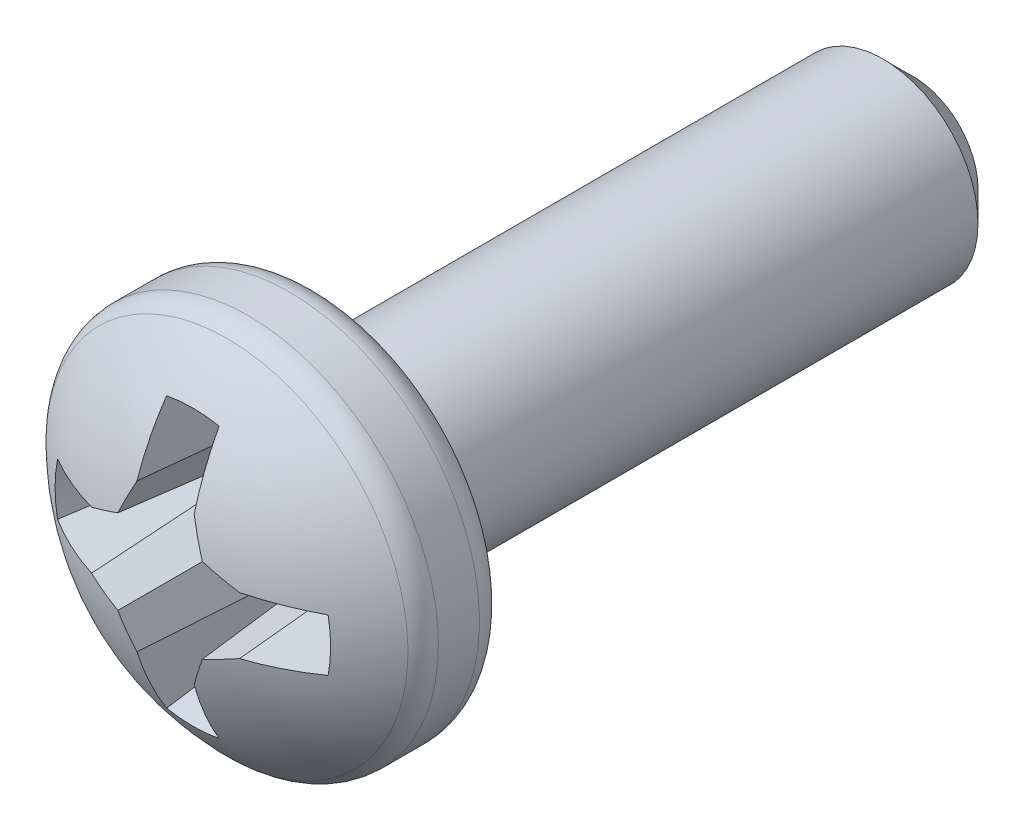
ISO-10303-21;
HEADER;
FILE_DESCRIPTION(('STEP AP214'),'2;1');
FILE_NAME('part.step','',(''),(''),'','','');
FILE_SCHEMA(('AUTOMOTIVE_DESIGN { 1 0 10303 214 1 1 1 1 }'));
ENDSEC;
DATA;
#1=APPLICATION_CONTEXT('core data for automotive mechanical design processes');
#2=APPLICATION_PROTOCOL_DEFINITION('international standard','automotive_design',2000,#1);
#3=PRODUCT_CONTEXT('',#1,'mechanical');
#4=PRODUCT('Part','Part','',(#3));
#5=PRODUCT_RELATED_PRODUCT_CATEGORY('part','',(#4));
#6=PRODUCT_DEFINITION_FORMATION('','',#4);
#7=PRODUCT_DEFINITION_CONTEXT('part definition',#1,'design');
#8=PRODUCT_DEFINITION('design','',#6,#7);
#9=PRODUCT_DEFINITION_SHAPE('','',#8);
#10=(LENGTH_UNIT() NAMED_UNIT(*) SI_UNIT(.MILLI.,.METRE.));
#11=(NAMED_UNIT(*) PLANE_ANGLE_UNIT() SI_UNIT($,.RADIAN.));
#12=(NAMED_UNIT(*) SI_UNIT($,.STERADIAN.) SOLID_ANGLE_UNIT());
#13=UNCERTAINTY_MEASURE_WITH_UNIT(LENGTH_MEASURE(1.E-05),#10,'distance_accuracy_value','');
#14=(GEOMETRIC_REPRESENTATION_CONTEXT(3) GLOBAL_UNCERTAINTY_ASSIGNED_CONTEXT((#13)) GLOBAL_UNIT_ASSIGNED_CONTEXT((#10,
#11,#12)) REPRESENTATION_CONTEXT('',''));
#15=CARTESIAN_POINT('',(0.,0.,0.));
#16=DIRECTION('',(0.,0.,1.));
#17=DIRECTION('',(1.,0.,0.));
#18=AXIS2_PLACEMENT_3D('',#15,#16,#17);
#19=CARTESIAN_POINT('',(-0.767521674615797,0.791461441644268,0.413196607862429));
#20=DIRECTION('',(0.,0.,1.));
#21=DIRECTION('',(1.,0.,0.));
#22=AXIS2_PLACEMENT_3D('',#19,#20,#21);
#23=PLANE('',#22);
#24=DIRECTION('',(0.382683432365081,-0.92387953251129,0.));
#25=VECTOR('',#24,1.);
#26=CARTESIAN_POINT('',(-0.754207787845929,0.796976234112247,0.413196607862429));
#27=LINE('',#26,#25);
#28=CARTESIAN_POINT('',(-0.761778033261303,0.815252423264536,0.413196607862429));
#29=VERTEX_POINT('',#28);
#30=CARTESIAN_POINT('',(-0.756492089679838,0.802491026580226,0.413196607862429));
#31=VERTEX_POINT('',#30);
#32=EDGE_CURVE('E292',#29,#31,#27,.T.);
#33=ORIENTED_EDGE('',*,*,#32,.F.);
#34=DIRECTION('',(0.,1.,0.));
#35=VECTOR('',#34,1.);
#36=CARTESIAN_POINT('',(-0.761778033261302,0.791461441644268,0.413196607862429));
#37=LINE('',#36,#35);
#38=CARTESIAN_POINT('',(-0.761778033261302,0.827667770312269,0.413196607862429));
#39=VERTEX_POINT('',#38);
#40=EDGE_CURVE('E168',#39,#29,#37,.F.);
#41=ORIENTED_EDGE('',*,*,#40,.F.);
#42=CARTESIAN_POINT('',(-0.767521674615797,0.791461441644268,0.413196607862429));
#43=DIRECTION('',(0.,0.,1.));
#44=DIRECTION('',(1.,0.,0.));
#45=AXIS2_PLACEMENT_3D('',#42,#43,#44);
#46=CIRCLE('',#45,0.0366590732510296);
#47=CARTESIAN_POINT('',(-0.773265315970288,0.827667770312269,0.413196607862429));
#48=VERTEX_POINT('',#47);
#49=EDGE_CURVE('E159',#39,#48,#46,.T.);
#50=ORIENTED_EDGE('',*,*,#49,.T.);
#51=DIRECTION('',(0.,1.,0.));
#52=VECTOR('',#51,1.);
#53=CARTESIAN_POINT('',(-0.773265315970287,0.791461441644271,0.413196607862429));
#54=LINE('',#53,#52);
#55=CARTESIAN_POINT('',(-0.773265315970288,0.815252423264539,0.413196607862429));
#56=VERTEX_POINT('',#55);
#57=EDGE_CURVE('E166',#56,#48,#54,.T.);
#58=ORIENTED_EDGE('',*,*,#57,.F.);
#59=DIRECTION('',(0.382683432365079,0.923879532511291,0.));
#60=VECTOR('',#59,1.);
#61=CARTESIAN_POINT('',(-0.780835561385661,0.79697623411225,0.413196607862429));
#62=LINE('',#61,#60);
#63=CARTESIAN_POINT('',(-0.778551259551752,0.802491026580229,0.413196607862429));
#64=VERTEX_POINT('',#63);
#65=EDGE_CURVE('E301',#64,#56,#62,.T.);
#66=ORIENTED_EDGE('',*,*,#65,.F.);
#67=DIRECTION('',(0.923879532511289,0.382683432365086,0.));
#68=VECTOR('',#67,1.);
#69=CARTESIAN_POINT('',(-0.773036467083772,0.804775328414139,0.413196607862429));
#70=LINE('',#69,#68);
#71=CARTESIAN_POINT('',(-0.791312656236062,0.797205082998765,0.413196607862429));
#72=VERTEX_POINT('',#71);
#73=EDGE_CURVE('E307',#72,#64,#70,.T.);
#74=ORIENTED_EDGE('',*,*,#73,.F.);
#75=DIRECTION('',(1.,0.,0.));
#76=VECTOR('',#75,1.);
#77=CARTESIAN_POINT('',(-0.767521674615793,0.797205082998765,0.413196607862429));
#78=LINE('',#77,#76);
#79=CARTESIAN_POINT('',(-0.803728003323473,0.797205082997996,0.413196607853642));
#80=VERTEX_POINT('',#79);
#81=EDGE_CURVE('E313',#80,#72,#78,.T.);
#82=ORIENTED_EDGE('',*,*,#81,.F.);
#83=CARTESIAN_POINT('',(-0.767521674615794,0.791461441644271,0.413196607862429));
#84=DIRECTION('',(0.,0.,1.));
#85=DIRECTION('',(1.,0.,0.));
#86=AXIS2_PLACEMENT_3D('',#83,#84,#85);
#87=CIRCLE('',#86,0.0366590732924525);
#88=CARTESIAN_POINT('',(-0.803728003325736,0.78571780028978,0.413196607862429));
#89=VERTEX_POINT('',#88);
#90=EDGE_CURVE('E410',#80,#89,#87,.T.);
#91=ORIENTED_EDGE('',*,*,#90,.T.);
#92=DIRECTION('',(1.,0.,0.));
#93=VECTOR('',#92,1.);
#94=CARTESIAN_POINT('',(-0.767521674615797,0.78571780028978,0.413196607862429));
#95=LINE('',#94,#93);
#96=CARTESIAN_POINT('',(-0.791312656236065,0.78571780028978,0.413196607862429));
#97=VERTEX_POINT('',#96);
#98=EDGE_CURVE('E247',#97,#89,#95,.F.);
#99=ORIENTED_EDGE('',*,*,#98,.F.);
#100=DIRECTION('',(-0.923879532511292,0.382683432365076,0.));
#101=VECTOR('',#100,1.);
#102=CARTESIAN_POINT('',(-0.773036467083776,0.778147554874406,0.413196607862429));
#103=LINE('',#102,#101);
#104=CARTESIAN_POINT('',(-0.778551259551755,0.780431856708316,0.413196607862429));
#105=VERTEX_POINT('',#104);
#106=EDGE_CURVE('E248',#105,#97,#103,.T.);
#107=ORIENTED_EDGE('',*,*,#106,.F.);
#108=DIRECTION('',(-0.38268343236509,0.923879532511287,0.));
#109=VECTOR('',#108,1.);
#110=CARTESIAN_POINT('',(-0.780835561385665,0.785946649176296,0.413196607862429));
#111=LINE('',#110,#109);
#112=CARTESIAN_POINT('',(-0.77326531597029,0.767670460024005,0.413196607862429));
#113=VERTEX_POINT('',#112);
#114=EDGE_CURVE('E254',#113,#105,#111,.T.);
#115=ORIENTED_EDGE('',*,*,#114,.F.);
#116=DIRECTION('',(0.,1.,0.));
#117=VECTOR('',#116,1.);
#118=CARTESIAN_POINT('',(-0.773265315970291,0.791461441644275,0.413196607862429));
#119=LINE('',#118,#117);
#120=CARTESIAN_POINT('',(-0.77326531597029,0.755255112934143,0.413196607862429));
#121=VERTEX_POINT('',#120);
#122=EDGE_CURVE('E260',#121,#113,#119,.T.);
#123=ORIENTED_EDGE('',*,*,#122,.F.);
#124=CARTESIAN_POINT('',(-0.767521674615796,0.791461441644275,0.413196607862429));
#125=DIRECTION('',(0.,0.,1.));
#126=DIRECTION('',(1.,0.,0.));
#127=AXIS2_PLACEMENT_3D('',#124,#125,#126);
#128=CIRCLE('',#127,0.0366590732926404);
#129=CARTESIAN_POINT('',(-0.761778033261305,0.755255112934142,0.413196607862429));
#130=VERTEX_POINT('',#129);
#131=EDGE_CURVE('E336',#121,#130,#128,.T.);
#132=ORIENTED_EDGE('',*,*,#131,.T.);
#133=DIRECTION('',(0.,1.,0.));
#134=VECTOR('',#133,1.);
#135=CARTESIAN_POINT('',(-0.761778033261306,0.791461441644272,0.413196607862429));
#136=LINE('',#135,#134);
#137=CARTESIAN_POINT('',(-0.761778033261305,0.767670460024002,0.413196607862429));
#138=VERTEX_POINT('',#137);
#139=EDGE_CURVE('E266',#138,#130,#136,.F.);
#140=ORIENTED_EDGE('',*,*,#139,.F.);
#141=DIRECTION('',(-0.382683432365075,-0.923879532511293,0.));
#142=VECTOR('',#141,1.);
#143=CARTESIAN_POINT('',(-0.754207787845931,0.785946649176293,0.413196607862429));
#144=LINE('',#143,#142);
#145=CARTESIAN_POINT('',(-0.756492089679841,0.780431856708313,0.413196607862429));
#146=VERTEX_POINT('',#145);
#147=EDGE_CURVE('E267',#146,#138,#144,.T.);
#148=ORIENTED_EDGE('',*,*,#147,.F.);
#149=DIRECTION('',(-0.923879532511286,-0.382683432365092,0.));
#150=VECTOR('',#149,1.);
#151=CARTESIAN_POINT('',(-0.762006882147821,0.778147554874402,0.413196607862429));
#152=LINE('',#151,#150);
#153=CARTESIAN_POINT('',(-0.743730692995531,0.785717800289777,0.413196607862429));
#154=VERTEX_POINT('',#153);
#155=EDGE_CURVE('E273',#154,#146,#152,.T.);
#156=ORIENTED_EDGE('',*,*,#155,.F.);
#157=DIRECTION('',(1.,0.,0.));
#158=VECTOR('',#157,1.);
#159=CARTESIAN_POINT('',(-0.7675216746158,0.785717800289777,0.413196607862429));
#160=LINE('',#159,#158);
#161=CARTESIAN_POINT('',(-0.731315345947796,0.785717800289777,0.413196607862429));
#162=VERTEX_POINT('',#161);
#163=EDGE_CURVE('E279',#162,#154,#160,.F.);
#164=ORIENTED_EDGE('',*,*,#163,.F.);
#165=CARTESIAN_POINT('',(-0.767521674615797,0.791461441644268,0.413196607862429));
#166=DIRECTION('',(0.,0.,1.));
#167=DIRECTION('',(1.,0.,0.));
#168=AXIS2_PLACEMENT_3D('',#165,#166,#167);
#169=CIRCLE('',#168,0.0366590732510296);
#170=CARTESIAN_POINT('',(-0.731315345947796,0.797205082998762,0.413196607862429));
#171=VERTEX_POINT('',#170);
#172=EDGE_CURVE('E492',#162,#171,#169,.T.);
#173=ORIENTED_EDGE('',*,*,#172,.T.);
#174=DIRECTION('',(1.,0.,0.));
#175=VECTOR('',#174,1.);
#176=CARTESIAN_POINT('',(-0.767521674615797,0.797205082998762,0.413196607862429));
#177=LINE('',#176,#175);
#178=CARTESIAN_POINT('',(-0.743730692995528,0.797205082998762,0.413196607862429));
#179=VERTEX_POINT('',#178);
#180=EDGE_CURVE('E285',#179,#171,#177,.T.);
#181=ORIENTED_EDGE('',*,*,#180,.F.);
#182=DIRECTION('',(0.92387953251129,-0.382683432365083,0.));
#183=VECTOR('',#182,1.);
#184=CARTESIAN_POINT('',(-0.762006882147817,0.804775328414136,0.413196607862429));
#185=LINE('',#184,#183);
#186=EDGE_CURVE('E286',#31,#179,#185,.T.);
#187=ORIENTED_EDGE('',*,*,#186,.F.);
#188=EDGE_LOOP('',(#33,#41,#50,#58,#66,#74,#82,#91,#99,#107,#115,#123,#132,#140,#148,#156,#164,
#173,#181,#187));
#189=FACE_BOUND('',#188,.T.);
#190=ADVANCED_FACE('F17',(#189),#23,.T.);
#191=CARTESIAN_POINT('',(-0.767521674615793,0.801303961329311,0.460047001563216));
#192=DIRECTION('',(0.,-0.996194698091744,0.0871557427476727));
#193=DIRECTION('',(0.,-0.0871557427476727,-0.996194698091744));
#194=AXIS2_PLACEMENT_3D('',#191,#192,#193);
#195=PLANE('',#194);
#196=DIRECTION('',(0.0173337504938446,-0.0871426484044557,-0.996045029063884));
#197=VECTOR('',#196,1.);
#198=CARTESIAN_POINT('',(-0.792056056740421,0.8009424097128,0.455914447676356));
#199=LINE('',#198,#197);
#200=CARTESIAN_POINT('',(-0.792056056740421,0.8009424097128,0.455914447676356));
#201=VERTEX_POINT('',#200);
#202=EDGE_CURVE('E310',#201,#72,#199,.T.);
#203=ORIENTED_EDGE('',*,*,#202,.F.);
#204=CARTESIAN_POINT('',(-0.8123693076876,0.80015108887588,0.446869609122098));
#205=CARTESIAN_POINT('',(-0.809180948004435,0.800321424804083,0.448816557690383));
#206=CARTESIAN_POINT('',(-0.805893997250592,0.800472536171256,0.450543768520713));
#207=CARTESIAN_POINT('',(-0.799122913601554,0.800736309783544,0.453558714705462));
#208=CARTESIAN_POINT('',(-0.795638780706358,0.800848972028658,0.45484645005988));
#209=CARTESIAN_POINT('',(-0.792056056740485,0.800942409712743,0.455914447676344));
#210=B_SPLINE_CURVE_WITH_KNOTS('',3,(#204,#205,#206,#207,#208,#209),.UNSPECIFIED.,.F.,.F.,(4,2,
4),(0.,0.0111485978671285,0.0222971957342569),.UNSPECIFIED.);
#211=CARTESIAN_POINT('',(-0.812369307677023,0.800151088874494,0.446869609106245));
#212=VERTEX_POINT('',#211);
#213=EDGE_CURVE('E409',#212,#201,#210,.T.);
#214=ORIENTED_EDGE('',*,*,#213,.F.);
#215=CARTESIAN_POINT('',(-0.812369307666445,0.800151088873107,0.446869609090391));
#216=CARTESIAN_POINT('',(-0.810932839888683,0.79966000435443,0.441256487356838));
#217=CARTESIAN_POINT('',(-0.809494497313129,0.799168961608414,0.435643843086986));
#218=CARTESIAN_POINT('',(-0.806614062531475,0.798186959649785,0.424419509338453));
#219=CARTESIAN_POINT('',(-0.805171970325285,0.797696000437175,0.418807819859794));
#220=CARTESIAN_POINT('',(-0.803728003321212,0.797205082997228,0.413196607844861));
#221=B_SPLINE_CURVE_WITH_KNOTS('',3,(#215,#216,#217,#218,#219,#220),.UNSPECIFIED.,.F.,.F.,(4,2,
4),(0.,0.0174443558891328,0.034888712201716),.UNSPECIFIED.);
#222=EDGE_CURVE('E318',#212,#80,#221,.T.);
#223=ORIENTED_EDGE('',*,*,#222,.T.);
#224=ORIENTED_EDGE('',*,*,#81,.T.);
#225=EDGE_LOOP('',(#203,#214,#223,#224));
#226=FACE_BOUND('',#225,.T.);
#227=ADVANCED_FACE('F427',(#226),#195,.T.);
#228=CARTESIAN_POINT('',(-0.774605039912152,0.808562198209984,0.460047001563216));
#229=DIRECTION('',(0.381227206369649,-0.920363891963225,0.0871557427476661));
#230=DIRECTION('',(0.923879532511289,0.382683432365086,0.));
#231=AXIS2_PLACEMENT_3D('',#228,#229,#230);
#232=PLANE('',#231);
#233=DIRECTION('',(0.0666626913468223,-0.0666626913468416,-0.995546167269401));
#234=VECTOR('',#233,1.);
#235=CARTESIAN_POINT('',(-0.781533038303313,0.805472805331791,0.457726739301586));
#236=LINE('',#235,#234);
#237=CARTESIAN_POINT('',(-0.781533038303313,0.805472805331791,0.457726739301586));
#238=VERTEX_POINT('',#237);
#239=EDGE_CURVE('E304',#238,#64,#236,.T.);
#240=ORIENTED_EDGE('',*,*,#239,.F.);
#241=CARTESIAN_POINT('',(-0.792056056740421,0.8009424097128,0.455914447676356));
#242=CARTESIAN_POINT('',(-0.790325687185486,0.801700049456703,0.456346321822599));
#243=CARTESIAN_POINT('',(-0.788583584204926,0.802456402296903,0.456713283197823));
#244=CARTESIAN_POINT('',(-0.785075911392557,0.8039665341699,0.457317380406233));
#245=CARTESIAN_POINT('',(-0.783310341560747,0.804720313202697,0.457554516239419));
#246=CARTESIAN_POINT('',(-0.781533038303313,0.805472805331791,0.457726739301586));
#247=B_SPLINE_CURVE_WITH_KNOTS('',3,(#241,#242,#243,#244,#245,#246),.UNSPECIFIED.,.F.,.F.,(4,2,
4),(0.,0.00580300590917737,0.0116060118183546),.UNSPECIFIED.);
#248=EDGE_CURVE('E439',#201,#238,#247,.T.);
#249=ORIENTED_EDGE('',*,*,#248,.F.);
#250=ORIENTED_EDGE('',*,*,#202,.T.);
#251=ORIENTED_EDGE('',*,*,#73,.T.);
#252=EDGE_LOOP('',(#240,#249,#250,#251));
#253=FACE_BOUND('',#252,.T.);
#254=ADVANCED_FACE('F431',(#253),#232,.T.);
#255=CARTESIAN_POINT('',(-0.784622431181506,0.79854480694063,0.460047001563216));
#256=DIRECTION('',(0.920363891963229,-0.381227206369643,0.0871557427476506));
#257=DIRECTION('',(0.382683432365079,0.923879532511291,0.));
#258=AXIS2_PLACEMENT_3D('',#255,#256,#257);
#259=PLANE('',#258);
#260=DIRECTION('',(0.0871426484044276,-0.0173337504938855,-0.996045029063886));
#261=VECTOR('',#260,1.);
#262=CARTESIAN_POINT('',(-0.777002642684322,0.8159958237689,0.455914447676355));
#263=LINE('',#262,#261);
#264=CARTESIAN_POINT('',(-0.777002642684322,0.8159958237689,0.455914447676355));
#265=VERTEX_POINT('',#264);
#266=EDGE_CURVE('E176',#265,#56,#263,.T.);
#267=ORIENTED_EDGE('',*,*,#266,.F.);
#268=CARTESIAN_POINT('',(-0.781533038303313,0.805472805331791,0.457726739301586));
#269=CARTESIAN_POINT('',(-0.780780546174218,0.807250108589226,0.457554516239419));
#270=CARTESIAN_POINT('',(-0.780026767141422,0.809015678421036,0.457317380406232));
#271=CARTESIAN_POINT('',(-0.778516635268425,0.812523351233405,0.456713283197822));
#272=CARTESIAN_POINT('',(-0.777760282428224,0.814265454213965,0.456346321822598));
#273=CARTESIAN_POINT('',(-0.777002642684322,0.8159958237689,0.455914447676355));
#274=B_SPLINE_CURVE_WITH_KNOTS('',3,(#268,#269,#270,#271,#272,#273),.UNSPECIFIED.,.F.,.F.,(4,2,
4),(0.,0.00580300590917795,0.0116060118183557),.UNSPECIFIED.);
#275=EDGE_CURVE('E445',#238,#265,#274,.T.);
#276=ORIENTED_EDGE('',*,*,#275,.F.);
#277=ORIENTED_EDGE('',*,*,#239,.T.);
#278=ORIENTED_EDGE('',*,*,#65,.T.);
#279=EDGE_LOOP('',(#267,#276,#277,#278));
#280=FACE_BOUND('',#279,.T.);
#281=ADVANCED_FACE('F436',(#280),#259,.T.);
#282=CARTESIAN_POINT('',(-0.777364194300832,0.791461441644271,0.460047001563216));
#283=DIRECTION('',(0.996194698091747,0.,0.0871557427476441));
#284=DIRECTION('',(0.0871557427476441,0.,-0.996194698091747));
#285=AXIS2_PLACEMENT_3D('',#282,#283,#284);
#286=PLANE('',#285);
#287=CARTESIAN_POINT('',(-0.773265315972061,0.827667770317489,0.413196607882704));
#288=CARTESIAN_POINT('',(-0.773756233411852,0.829111737328409,0.418807819895843));
#289=CARTESIAN_POINT('',(-0.774247192624304,0.830553829541472,0.424419509372702));
#290=CARTESIAN_POINT('',(-0.775229194582617,0.833434264336921,0.435643843117629));
#291=CARTESIAN_POINT('',(-0.775720237328474,0.834872606919398,0.441256487385674));
#292=CARTESIAN_POINT('',(-0.776211321846993,0.836309074704109,0.446869609117416));
#293=B_SPLINE_CURVE_WITH_KNOTS('',3,(#287,#288,#289,#290,#291,#292),.UNSPECIFIED.,.F.,.F.,(4,2,
4),(0.,0.0174443563124476,0.0348887122014449),.UNSPECIFIED.);
#294=CARTESIAN_POINT('',(-0.776211321846523,0.836309074702734,0.446869609112043));
#295=VERTEX_POINT('',#294);
#296=EDGE_CURVE('E170',#48,#295,#293,.T.);
#297=ORIENTED_EDGE('',*,*,#296,.T.);
#298=CARTESIAN_POINT('',(-0.777002642684322,0.8159958237689,0.455914447676355));
#299=CARTESIAN_POINT('',(-0.776909205000247,0.819578547733282,0.454846450060344));
#300=CARTESIAN_POINT('',(-0.776796542755169,0.823062680627081,0.453558714706553));
#301=CARTESIAN_POINT('',(-0.776532769143005,0.82983376427351,0.450543768523407));
#302=CARTESIAN_POINT('',(-0.776381657775919,0.83312071502614,0.448816557694053));
#303=CARTESIAN_POINT('',(-0.776211321847829,0.836309074708187,0.446869609126918));
#304=B_SPLINE_CURVE_WITH_KNOTS('',3,(#298,#299,#300,#301,#302,#303),.UNSPECIFIED.,.F.,.F.,(4,2,
4),(0.,0.0111485978625417,0.0222971957250834),.UNSPECIFIED.);
#305=EDGE_CURVE('E450',#265,#295,#304,.T.);
#306=ORIENTED_EDGE('',*,*,#305,.F.);
#307=ORIENTED_EDGE('',*,*,#266,.T.);
#308=ORIENTED_EDGE('',*,*,#57,.T.);
#309=EDGE_LOOP('',(#297,#306,#307,#308));
#310=FACE_BOUND('',#309,.T.);
#311=ADVANCED_FACE('F173',(#310),#286,.T.);
#312=CARTESIAN_POINT('',(-0.767521674615797,0.791461441644268,0.446869608992984));
#313=DIRECTION('',(0.,0.,1.));
#314=DIRECTION('',(1.,0.,0.));
#315=AXIS2_PLACEMENT_3D('',#312,#313,#314);
#316=CONICAL_SURFACE('',#315,0.0456817267299142,0.261799388331704);
#317=ORIENTED_EDGE('',*,*,#296,.F.);
#318=ORIENTED_EDGE('',*,*,#49,.F.);
#319=CARTESIAN_POINT('',(-0.758832027383948,0.836309074706007,0.446869609124833));
#320=CARTESIAN_POINT('',(-0.759323111902729,0.834872606920528,0.441256487390083));
#321=CARTESIAN_POINT('',(-0.75981415464885,0.83343426433728,0.43564384311903));
#322=CARTESIAN_POINT('',(-0.760796156607689,0.830553829540286,0.424419509368088));
#323=CARTESIAN_POINT('',(-0.761287115820405,0.829111737326449,0.418807819888222));
#324=CARTESIAN_POINT('',(-0.761778033260458,0.827667770314752,0.413196607872077));
#325=B_SPLINE_CURVE_WITH_KNOTS('',3,(#319,#320,#321,#322,#323,#324),.UNSPECIFIED.,.F.,.F.,(4,2,
4),(0.,0.0174443558983455,0.0348887122201413),.UNSPECIFIED.);
#326=CARTESIAN_POINT('',(-0.758832027383806,0.836309074706142,0.446869609126459));
#327=VERTEX_POINT('',#326);
#328=EDGE_CURVE('E182',#327,#39,#325,.T.);
#329=ORIENTED_EDGE('',*,*,#328,.F.);
#330=CARTESIAN_POINT('',(-0.767521674615797,0.791461441644268,0.44686960910667));
#331=DIRECTION('',(0.,0.,1.));
#332=DIRECTION('',(1.,0.,0.));
#333=AXIS2_PLACEMENT_3D('',#330,#331,#332);
#334=CIRCLE('',#333,0.0456817267603765);
#335=EDGE_CURVE('E180',#295,#327,#334,.F.);
#336=ORIENTED_EDGE('',*,*,#335,.F.);
#337=EDGE_LOOP('',(#317,#318,#329,#336));
#338=FACE_BOUND('',#337,.T.);
#339=ADVANCED_FACE('F178',(#338),#316,.F.);
#340=CARTESIAN_POINT('',(-0.757679154930757,0.791461441644268,0.460047001563216));
#341=DIRECTION('',(-0.996194698091746,0.,0.0871557427476584));
#342=DIRECTION('',(0.0871557427476584,0.,0.996194698091746));
#343=AXIS2_PLACEMENT_3D('',#340,#341,#342);
#344=PLANE('',#343);
#345=DIRECTION('',(-0.0871426484044379,-0.0173337504938648,-0.996045029063886));
#346=VECTOR('',#345,1.);
#347=CARTESIAN_POINT('',(-0.758040706547268,0.815995823768896,0.455914447676356));
#348=LINE('',#347,#346);
#349=CARTESIAN_POINT('',(-0.758040706547268,0.815995823768896,0.455914447676356));
#350=VERTEX_POINT('',#349);
#351=EDGE_CURVE('E295',#350,#29,#348,.T.);
#352=ORIENTED_EDGE('',*,*,#351,.F.);
#353=CARTESIAN_POINT('',(-0.758832027383663,0.836309074706278,0.446869609128086));
#354=CARTESIAN_POINT('',(-0.758661691455596,0.833120715024506,0.448816557694939));
#355=CARTESIAN_POINT('',(-0.75851058008853,0.829833764272172,0.450543768524055));
#356=CARTESIAN_POINT('',(-0.758246806476396,0.823062680626383,0.45355871470681));
#357=CARTESIAN_POINT('',(-0.758134144231329,0.819578547732927,0.454846450060449));
#358=CARTESIAN_POINT('',(-0.758040706547262,0.81599582376891,0.45591444767635));
#359=B_SPLINE_CURVE_WITH_KNOTS('',3,(#353,#354,#355,#356,#357,#358),.UNSPECIFIED.,.F.,.F.,(4,2,
4),(0.,0.0111485978614188,0.0222971957228374),.UNSPECIFIED.);
#360=EDGE_CURVE('E210',#327,#350,#359,.T.);
#361=ORIENTED_EDGE('',*,*,#360,.F.);
#362=ORIENTED_EDGE('',*,*,#328,.T.);
#363=ORIENTED_EDGE('',*,*,#40,.T.);
#364=EDGE_LOOP('',(#352,#361,#362,#363));
#365=FACE_BOUND('',#364,.T.);
#366=ADVANCED_FACE('F199',(#365),#344,.T.);
#367=CARTESIAN_POINT('',(-0.750420918050084,0.798544806940627,0.460047001563216));
#368=DIRECTION('',(-0.920363891963228,-0.381227206369645,0.0871557427476584));
#369=DIRECTION('',(0.382683432365081,-0.92387953251129,0.));
#370=AXIS2_PLACEMENT_3D('',#367,#368,#369);
#371=PLANE('',#370);
#372=DIRECTION('',(-0.0666626913468367,-0.0666626913468319,-0.995546167269401));
#373=VECTOR('',#372,1.);
#374=CARTESIAN_POINT('',(-0.753510310928276,0.805472805331788,0.457726739301586));
#375=LINE('',#374,#373);
#376=CARTESIAN_POINT('',(-0.753510310928276,0.805472805331788,0.457726739301586));
#377=VERTEX_POINT('',#376);
#378=EDGE_CURVE('E289',#377,#31,#375,.T.);
#379=ORIENTED_EDGE('',*,*,#378,.F.);
#380=CARTESIAN_POINT('',(-0.758040706547268,0.815995823768896,0.455914447676356));
#381=CARTESIAN_POINT('',(-0.757283066803365,0.814265454213961,0.456346321822599));
#382=CARTESIAN_POINT('',(-0.756526713963165,0.812523351233401,0.456713283197823));
#383=CARTESIAN_POINT('',(-0.755016582090168,0.809015678421032,0.457317380406233));
#384=CARTESIAN_POINT('',(-0.754262803057371,0.807250108589222,0.457554516239419));
#385=CARTESIAN_POINT('',(-0.753510310928277,0.805472805331787,0.457726739301586));
#386=B_SPLINE_CURVE_WITH_KNOTS('',3,(#380,#381,#382,#383,#384,#385),.UNSPECIFIED.,.F.,.F.,(4,2,
4),(0.,0.00580300590917724,0.0116060118183544),.UNSPECIFIED.);
#387=EDGE_CURVE('E218',#350,#377,#386,.T.);
#388=ORIENTED_EDGE('',*,*,#387,.F.);
#389=ORIENTED_EDGE('',*,*,#351,.T.);
#390=ORIENTED_EDGE('',*,*,#32,.T.);
#391=EDGE_LOOP('',(#379,#388,#389,#390));
#392=FACE_BOUND('',#391,.T.);
#393=ADVANCED_FACE('F204',(#392),#371,.T.);
#394=CARTESIAN_POINT('',(-0.760438309319437,0.808562198209981,0.460047001563216));
#395=DIRECTION('',(-0.381227206369647,-0.920363891963227,0.0871557427476583));
#396=DIRECTION('',(0.92387953251129,-0.382683432365083,0.));
#397=AXIS2_PLACEMENT_3D('',#394,#395,#396);
#398=PLANE('',#397);
#399=DIRECTION('',(-0.0173337504938598,-0.0871426484044405,-0.996045029063885));
#400=VECTOR('',#399,1.);
#401=CARTESIAN_POINT('',(-0.742987292491168,0.800942409712797,0.455914447676356));
#402=LINE('',#401,#400);
#403=CARTESIAN_POINT('',(-0.742987292491168,0.800942409712797,0.455914447676356));
#404=VERTEX_POINT('',#403);
#405=EDGE_CURVE('E282',#404,#179,#402,.T.);
#406=ORIENTED_EDGE('',*,*,#405,.F.);
#407=CARTESIAN_POINT('',(-0.753510310928276,0.805472805331788,0.457726739301586));
#408=CARTESIAN_POINT('',(-0.751733007670842,0.804720313202694,0.457554516239419));
#409=CARTESIAN_POINT('',(-0.749967437839032,0.803966534169897,0.457317380406232));
#410=CARTESIAN_POINT('',(-0.746459765026663,0.8024564022969,0.456713283197822));
#411=CARTESIAN_POINT('',(-0.744717662046103,0.8017000494567,0.456346321822598));
#412=CARTESIAN_POINT('',(-0.742987292491168,0.800942409712797,0.455914447676355));
#413=B_SPLINE_CURVE_WITH_KNOTS('',3,(#407,#408,#409,#410,#411,#412),.UNSPECIFIED.,.F.,.F.,(4,2,
4),(0.,0.00580300590917727,0.0116060118183545),.UNSPECIFIED.);
#414=EDGE_CURVE('E462',#377,#404,#413,.T.);
#415=ORIENTED_EDGE('',*,*,#414,.F.);
#416=ORIENTED_EDGE('',*,*,#378,.T.);
#417=ORIENTED_EDGE('',*,*,#186,.T.);
#418=EDGE_LOOP('',(#406,#415,#416,#417));
#419=FACE_BOUND('',#418,.T.);
#420=ADVANCED_FACE('F474',(#419),#398,.T.);
#421=CARTESIAN_POINT('',(-0.767521674615797,0.801303961329307,0.460047001563216));
#422=DIRECTION('',(0.,-0.996194698091746,0.0871557427476584));
#423=DIRECTION('',(0.,-0.0871557427476584,-0.996194698091746));
#424=AXIS2_PLACEMENT_3D('',#421,#422,#423);
#425=PLANE('',#424);
#426=CARTESIAN_POINT('',(-0.731315345942685,0.797205083000499,0.413196607882285));
#427=CARTESIAN_POINT('',(-0.729871378931746,0.797696000440295,0.418807819895494));
#428=CARTESIAN_POINT('',(-0.728429286718666,0.798186959652754,0.424419509372423));
#429=CARTESIAN_POINT('',(-0.725548851923181,0.799168961611079,0.435643843117489));
#430=CARTESIAN_POINT('',(-0.724110509340685,0.799660004356943,0.441256487385604));
#431=CARTESIAN_POINT('',(-0.722674041555957,0.800151088875467,0.446869609117416));
#432=B_SPLINE_CURVE_WITH_KNOTS('',3,(#426,#427,#428,#429,#430,#431),.UNSPECIFIED.,.F.,.F.,(4,2,
4),(0.,0.0174443563126647,0.034888712201879),.UNSPECIFIED.);
#433=CARTESIAN_POINT('',(-0.722674041557332,0.800151088874997,0.446869609112043));
#434=VERTEX_POINT('',#433);
#435=EDGE_CURVE('E351',#171,#434,#432,.T.);
#436=ORIENTED_EDGE('',*,*,#435,.T.);
#437=CARTESIAN_POINT('',(-0.742987292491168,0.800942409712797,0.455914447676355));
#438=CARTESIAN_POINT('',(-0.739404568526773,0.800848972028741,0.454846450060339));
#439=CARTESIAN_POINT('',(-0.735920435632963,0.800736309783662,0.453558714706542));
#440=CARTESIAN_POINT('',(-0.72914935198651,0.800472536171458,0.450543768523388));
#441=CARTESIAN_POINT('',(-0.725862401233869,0.800321424804333,0.44881655769403));
#442=CARTESIAN_POINT('',(-0.722674041551812,0.800151088876185,0.446869609126891));
#443=B_SPLINE_CURVE_WITH_KNOTS('',3,(#437,#438,#439,#440,#441,#442),.UNSPECIFIED.,.F.,.F.,(4,2,
4),(0.,0.0111485978625814,0.0222971957251628),.UNSPECIFIED.);
#444=EDGE_CURVE('E463',#404,#434,#443,.T.);
#445=ORIENTED_EDGE('',*,*,#444,.F.);
#446=ORIENTED_EDGE('',*,*,#405,.T.);
#447=ORIENTED_EDGE('',*,*,#180,.T.);
#448=EDGE_LOOP('',(#436,#445,#446,#447));
#449=FACE_BOUND('',#448,.T.);
#450=ADVANCED_FACE('F477',(#449),#425,.T.);
#451=CARTESIAN_POINT('',(-0.767521674615797,0.791461441644268,0.446869608992984));
#452=DIRECTION('',(0.,0.,1.));
#453=DIRECTION('',(1.,0.,0.));
#454=AXIS2_PLACEMENT_3D('',#451,#452,#453);
#455=CONICAL_SURFACE('',#454,0.0456817267299142,0.261799388331704);
#456=ORIENTED_EDGE('',*,*,#172,.F.);
#457=CARTESIAN_POINT('',(-0.722674041554058,0.782771794412423,0.446869609124833));
#458=CARTESIAN_POINT('',(-0.724110509339554,0.783262878931211,0.441256487390013));
#459=CARTESIAN_POINT('',(-0.72554885192282,0.783753921677337,0.435643843118891));
#460=CARTESIAN_POINT('',(-0.72842928671985,0.784735923636188,0.42441950936781));
#461=CARTESIAN_POINT('',(-0.729871378933704,0.78522688284891,0.418807819887874));
#462=CARTESIAN_POINT('',(-0.731315345945419,0.785717800288969,0.41319660787166));
#463=B_SPLINE_CURVE_WITH_KNOTS('',3,(#457,#458,#459,#460,#461,#462),.UNSPECIFIED.,.F.,.F.,(4,2,
4),(0.,0.0174443558985619,0.0348887122205742),.UNSPECIFIED.);
#464=CARTESIAN_POINT('',(-0.722674041553922,0.782771794412281,0.446869609126459));
#465=VERTEX_POINT('',#464);
#466=EDGE_CURVE('E346',#465,#162,#463,.T.);
#467=ORIENTED_EDGE('',*,*,#466,.F.);
#468=CARTESIAN_POINT('',(-0.767521674615797,0.791461441644268,0.44686960910667));
#469=DIRECTION('',(0.,0.,1.));
#470=DIRECTION('',(1.,0.,0.));
#471=AXIS2_PLACEMENT_3D('',#468,#469,#470);
#472=CIRCLE('',#471,0.0456817267603765);
#473=EDGE_CURVE('E464',#434,#465,#472,.F.);
#474=ORIENTED_EDGE('',*,*,#473,.F.);
#475=ORIENTED_EDGE('',*,*,#435,.F.);
#476=EDGE_LOOP('',(#456,#467,#474,#475));
#477=FACE_BOUND('',#476,.T.);
#478=ADVANCED_FACE('F482',(#477),#455,.F.);
#479=CARTESIAN_POINT('',(-0.7675216746158,0.781618921959232,0.460047001563216));
#480=DIRECTION('',(0.,0.996194698091747,0.0871557427476441));
#481=DIRECTION('',(0.,-0.0871557427476441,0.996194698091747));
#482=AXIS2_PLACEMENT_3D('',#479,#480,#481);
#483=PLANE('',#482);
#484=DIRECTION('',(-0.0173337504938417,0.0871426484044261,-0.996045029063887));
#485=VECTOR('',#484,1.);
#486=CARTESIAN_POINT('',(-0.742987292491172,0.781980473575742,0.455914447676357));
#487=LINE('',#486,#485);
#488=CARTESIAN_POINT('',(-0.742987292491172,0.781980473575742,0.455914447676357));
#489=VERTEX_POINT('',#488);
#490=EDGE_CURVE('E276',#489,#154,#487,.T.);
#491=ORIENTED_EDGE('',*,*,#490,.F.);
#492=CARTESIAN_POINT('',(-0.722674041553786,0.782771794412139,0.446869609128085));
#493=CARTESIAN_POINT('',(-0.725862401235551,0.782601458484062,0.448816557694934));
#494=CARTESIAN_POINT('',(-0.729149351987878,0.782450347116995,0.450543768524046));
#495=CARTESIAN_POINT('',(-0.735920435633652,0.782186573504882,0.453558714706799));
#496=CARTESIAN_POINT('',(-0.7394045685271,0.782073911259836,0.45484645006044));
#497=CARTESIAN_POINT('',(-0.742987292491108,0.7819804735758,0.455914447676344));
#498=B_SPLINE_CURVE_WITH_KNOTS('',3,(#492,#493,#494,#495,#496,#497),.UNSPECIFIED.,.F.,.F.,(4,2,
4),(0.,0.0111485978613955,0.0222971957227909),.UNSPECIFIED.);
#499=EDGE_CURVE('E509',#465,#489,#498,.T.);
#500=ORIENTED_EDGE('',*,*,#499,.F.);
#501=ORIENTED_EDGE('',*,*,#466,.T.);
#502=ORIENTED_EDGE('',*,*,#163,.T.);
#503=EDGE_LOOP('',(#491,#500,#501,#502));
#504=FACE_BOUND('',#503,.T.);
#505=ADVANCED_FACE('F499',(#504),#483,.T.);
#506=CARTESIAN_POINT('',(-0.760438309319441,0.774360685078558,0.460047001563216));
#507=DIRECTION('',(-0.381227206369656,0.920363891963225,0.0871557427476397));
#508=DIRECTION('',(-0.923879532511286,-0.382683432365092,0.));
#509=AXIS2_PLACEMENT_3D('',#506,#507,#508);
#510=PLANE('',#509);
#511=DIRECTION('',(-0.066662691346817,0.0666626913468194,-0.995546167269403));
#512=VECTOR('',#511,1.);
#513=CARTESIAN_POINT('',(-0.75351031092828,0.777450077956752,0.457726739301588));
#514=LINE('',#513,#512);
#515=CARTESIAN_POINT('',(-0.75351031092828,0.777450077956752,0.457726739301588));
#516=VERTEX_POINT('',#515);
#517=EDGE_CURVE('E270',#516,#146,#514,.T.);
#518=ORIENTED_EDGE('',*,*,#517,.F.);
#519=CARTESIAN_POINT('',(-0.742987292491172,0.781980473575742,0.455914447676357));
#520=CARTESIAN_POINT('',(-0.744717662046107,0.781222833831839,0.4563463218226));
#521=CARTESIAN_POINT('',(-0.746459765026666,0.780466480991639,0.456713283197824));
#522=CARTESIAN_POINT('',(-0.749967437839036,0.778956349118642,0.457317380406234));
#523=CARTESIAN_POINT('',(-0.751733007670845,0.778202570085846,0.45755451623942));
#524=CARTESIAN_POINT('',(-0.75351031092828,0.777450077956751,0.457726739301587));
#525=B_SPLINE_CURVE_WITH_KNOTS('',3,(#519,#520,#521,#522,#523,#524),.UNSPECIFIED.,.F.,.F.,(4,2,
4),(0.,0.00580300590917722,0.0116060118183545),.UNSPECIFIED.);
#526=EDGE_CURVE('E515',#489,#516,#525,.T.);
#527=ORIENTED_EDGE('',*,*,#526,.F.);
#528=ORIENTED_EDGE('',*,*,#490,.T.);
#529=ORIENTED_EDGE('',*,*,#155,.T.);
#530=EDGE_LOOP('',(#518,#527,#528,#529));
#531=FACE_BOUND('',#530,.T.);
#532=ADVANCED_FACE('F503',(#531),#510,.T.);
#533=CARTESIAN_POINT('',(-0.750420918050087,0.784378076347913,0.460047001563216));
#534=DIRECTION('',(-0.920363891963232,0.381227206369639,0.0871557427476397));
#535=DIRECTION('',(-0.382683432365075,-0.923879532511293,0.));
#536=AXIS2_PLACEMENT_3D('',#533,#534,#535);
#537=PLANE('',#536);
#538=DIRECTION('',(-0.087142648404426,0.0173337504938367,-0.996045029063887));
#539=VECTOR('',#538,1.);
#540=CARTESIAN_POINT('',(-0.758040706547271,0.766927059519643,0.455914447676357));
#541=LINE('',#540,#539);
#542=CARTESIAN_POINT('',(-0.758040706547271,0.766927059519643,0.455914447676357));
#543=VERTEX_POINT('',#542);
#544=EDGE_CURVE('E263',#543,#138,#541,.T.);
#545=ORIENTED_EDGE('',*,*,#544,.F.);
#546=CARTESIAN_POINT('',(-0.75351031092828,0.777450077956752,0.457726739301587));
#547=CARTESIAN_POINT('',(-0.754262803057374,0.775672774699317,0.45755451623942));
#548=CARTESIAN_POINT('',(-0.755016582090171,0.773907204867507,0.457317380406234));
#549=CARTESIAN_POINT('',(-0.756526713963168,0.770399532055138,0.456713283197824));
#550=CARTESIAN_POINT('',(-0.757283066803368,0.768657429074578,0.4563463218226));
#551=CARTESIAN_POINT('',(-0.758040706547271,0.766927059519643,0.455914447676357));
#552=B_SPLINE_CURVE_WITH_KNOTS('',3,(#546,#547,#548,#549,#550,#551),.UNSPECIFIED.,.F.,.F.,(4,2,
4),(0.,0.00580300590917774,0.0116060118183553),.UNSPECIFIED.);
#553=EDGE_CURVE('E535',#516,#543,#552,.T.);
#554=ORIENTED_EDGE('',*,*,#553,.F.);
#555=ORIENTED_EDGE('',*,*,#517,.T.);
#556=ORIENTED_EDGE('',*,*,#147,.T.);
#557=EDGE_LOOP('',(#545,#554,#555,#556));
#558=FACE_BOUND('',#557,.T.);
#559=ADVANCED_FACE('F548',(#558),#537,.T.);
#560=CARTESIAN_POINT('',(-0.757679154930761,0.791461441644272,0.460047001563216));
#561=DIRECTION('',(-0.996194698091747,0.,0.0871557427476441));
#562=DIRECTION('',(0.0871557427476441,0.,0.996194698091747));
#563=AXIS2_PLACEMENT_3D('',#560,#561,#562);
#564=PLANE('',#563);
#565=CARTESIAN_POINT('',(-0.761778033265711,0.7552551129409,0.413196607846558));
#566=CARTESIAN_POINT('',(-0.761287115823564,0.753811145926433,0.4188078198694));
#567=CARTESIAN_POINT('',(-0.760796156609243,0.752369053710243,0.424419509356112));
#568=CARTESIAN_POINT('',(-0.759814154648174,0.749488618909373,0.435643843121045));
#569=CARTESIAN_POINT('',(-0.759323111901428,0.748050276324602,0.441256487399243));
#570=CARTESIAN_POINT('',(-0.758832027382512,0.746613808538017,0.446869609141288));
#571=B_SPLINE_CURVE_WITH_KNOTS('',3,(#565,#566,#567,#568,#569,#570),.UNSPECIFIED.,.F.,.F.,(4,2,
4),(0.,0.0174443563437747,0.034888712264098),.UNSPECIFIED.);
#572=CARTESIAN_POINT('',(-0.758832027381539,0.746613808535171,0.446869609152406));
#573=VERTEX_POINT('',#572);
#574=EDGE_CURVE('E559',#130,#573,#571,.T.);
#575=ORIENTED_EDGE('',*,*,#574,.T.);
#576=CARTESIAN_POINT('',(-0.758040706547271,0.766927059519643,0.455914447676357));
#577=CARTESIAN_POINT('',(-0.75813414423138,0.76334433555394,0.454846450059951));
#578=CARTESIAN_POINT('',(-0.758246806476506,0.759860202658903,0.453558714705608));
#579=CARTESIAN_POINT('',(-0.758510580088794,0.753089119010161,0.450543768521049));
#580=CARTESIAN_POINT('',(-0.758661691455956,0.749802168256456,0.448816557690833));
#581=CARTESIAN_POINT('',(-0.758832027384134,0.746613808573418,0.44686960912268));
#582=B_SPLINE_CURVE_WITH_KNOTS('',3,(#576,#577,#578,#579,#580,#581),.UNSPECIFIED.,.F.,.F.,(4,2,
4),(0.,0.011148597866603,0.0222971957332061),.UNSPECIFIED.);
#583=EDGE_CURVE('E536',#543,#573,#582,.T.);
#584=ORIENTED_EDGE('',*,*,#583,.F.);
#585=ORIENTED_EDGE('',*,*,#544,.T.);
#586=ORIENTED_EDGE('',*,*,#139,.T.);
#587=EDGE_LOOP('',(#575,#584,#585,#586));
#588=FACE_BOUND('',#587,.T.);
#589=ADVANCED_FACE('F551',(#588),#564,.T.);
#590=CARTESIAN_POINT('',(-0.767521674615796,0.791461441644275,0.446869609163513));
#591=DIRECTION('',(0.,0.,1.));
#592=DIRECTION('',(0.,-1.,0.));
#593=AXIS2_PLACEMENT_3D('',#590,#591,#592);
#594=CONICAL_SURFACE('',#593,0.0456817268151781,0.261799388275177);
#595=ORIENTED_EDGE('',*,*,#131,.F.);
#596=CARTESIAN_POINT('',(-0.776211321835818,0.746613808551457,0.446869609129835));
#597=CARTESIAN_POINT('',(-0.775720237322711,0.74805027633271,0.441256487389852));
#598=CARTESIAN_POINT('',(-0.775229194580272,0.749488618913338,0.435643843114153));
#599=CARTESIAN_POINT('',(-0.774247192624811,0.752369053708309,0.424419509355091));
#600=CARTESIAN_POINT('',(-0.773756233411791,0.753811145922742,0.418807819871752));
#601=CARTESIAN_POINT('',(-0.773265315969441,0.755255112936642,0.41319660785272));
#602=B_SPLINE_CURVE_WITH_KNOTS('',3,(#596,#597,#598,#599,#600,#601),.UNSPECIFIED.,.F.,.F.,(4,2,
4),(0.,0.0174443559089244,0.0348887122412963),.UNSPECIFIED.);
#603=CARTESIAN_POINT('',(-0.776211321847657,0.746613808558396,0.446869609124972));
#604=VERTEX_POINT('',#603);
#605=EDGE_CURVE('E331',#604,#121,#602,.T.);
#606=ORIENTED_EDGE('',*,*,#605,.F.);
#607=CARTESIAN_POINT('',(-0.767521674615796,0.791461441644275,0.446869609163513));
#608=DIRECTION('',(0.,0.,1.));
#609=DIRECTION('',(0.,-1.,0.));
#610=AXIS2_PLACEMENT_3D('',#607,#608,#609);
#611=CIRCLE('',#610,0.0456817268151781);
#612=EDGE_CURVE('E538',#573,#604,#611,.F.);
#613=ORIENTED_EDGE('',*,*,#612,.F.);
#614=ORIENTED_EDGE('',*,*,#574,.F.);
#615=EDGE_LOOP('',(#595,#606,#613,#614));
#616=FACE_BOUND('',#615,.T.);
#617=ADVANCED_FACE('F555',(#616),#594,.F.);
#618=CARTESIAN_POINT('',(-0.777364194300836,0.791461441644275,0.460047001563216));
#619=DIRECTION('',(0.996194698091746,0.,0.0871557427476584));
#620=DIRECTION('',(0.0871557427476584,0.,-0.996194698091746));
#621=AXIS2_PLACEMENT_3D('',#618,#619,#620);
#622=PLANE('',#621);
#623=DIRECTION('',(0.0871426484044388,0.0173337504938337,-0.996045029063886));
#624=VECTOR('',#623,1.);
#625=CARTESIAN_POINT('',(-0.777002642684325,0.766927059519646,0.455914447676358));
#626=LINE('',#625,#624);
#627=CARTESIAN_POINT('',(-0.777002642684325,0.766927059519646,0.455914447676358));
#628=VERTEX_POINT('',#627);
#629=EDGE_CURVE('E257',#628,#113,#626,.T.);
#630=ORIENTED_EDGE('',*,*,#629,.F.);
#631=CARTESIAN_POINT('',(-0.776211321847538,0.746613808574946,0.446869609123615));
#632=CARTESIAN_POINT('',(-0.776381657775699,0.749802168257764,0.448816557691542));
#633=CARTESIAN_POINT('',(-0.776532769142846,0.753089119011231,0.450543768521567));
#634=CARTESIAN_POINT('',(-0.77679654275511,0.759860202659459,0.453558714705813));
#635=CARTESIAN_POINT('',(-0.776909205000228,0.763344335554222,0.454846450060034));
#636=CARTESIAN_POINT('',(-0.777002642684331,0.766927059519632,0.455914447676352));
#637=B_SPLINE_CURVE_WITH_KNOTS('',3,(#631,#632,#633,#634,#635,#636),.UNSPECIFIED.,.F.,.F.,(4,2,
4),(0.,0.0111485978657023,0.0222971957314048),.UNSPECIFIED.);
#638=EDGE_CURVE('E574',#604,#628,#637,.T.);
#639=ORIENTED_EDGE('',*,*,#638,.F.);
#640=ORIENTED_EDGE('',*,*,#605,.T.);
#641=ORIENTED_EDGE('',*,*,#122,.T.);
#642=EDGE_LOOP('',(#630,#639,#640,#641));
#643=FACE_BOUND('',#642,.T.);
#644=ADVANCED_FACE('F582',(#643),#622,.T.);
#645=CARTESIAN_POINT('',(-0.784622431181509,0.784378076347916,0.460047001563216));
#646=DIRECTION('',(0.920363891963225,0.381227206369654,0.0871557427476474));
#647=DIRECTION('',(-0.38268343236509,0.923879532511287,0.));
#648=AXIS2_PLACEMENT_3D('',#645,#646,#647);
#649=PLANE('',#648);
#650=DIRECTION('',(0.0666626913468243,0.0666626913468074,-0.995546167269403));
#651=VECTOR('',#650,1.);
#652=CARTESIAN_POINT('',(-0.781533038303316,0.777450077956755,0.457726739301588));
#653=LINE('',#652,#651);
#654=CARTESIAN_POINT('',(-0.781533038303316,0.777450077956755,0.457726739301588));
#655=VERTEX_POINT('',#654);
#656=EDGE_CURVE('E251',#655,#105,#653,.T.);
#657=ORIENTED_EDGE('',*,*,#656,.F.);
#658=CARTESIAN_POINT('',(-0.777002642684325,0.766927059519647,0.455914447676357));
#659=CARTESIAN_POINT('',(-0.777760282428228,0.768657429074581,0.4563463218226));
#660=CARTESIAN_POINT('',(-0.778516635268428,0.770399532055141,0.456713283197824));
#661=CARTESIAN_POINT('',(-0.780026767141425,0.773907204867511,0.457317380406234));
#662=CARTESIAN_POINT('',(-0.780780546174222,0.775672774699321,0.45755451623942));
#663=CARTESIAN_POINT('',(-0.781533038303316,0.777450077956755,0.457726739301587));
#664=B_SPLINE_CURVE_WITH_KNOTS('',3,(#658,#659,#660,#661,#662,#663),.UNSPECIFIED.,.F.,.F.,(4,2,
4),(0.,0.00580300590917765,0.0116060118183551),.UNSPECIFIED.);
#665=EDGE_CURVE('E575',#628,#655,#664,.T.);
#666=ORIENTED_EDGE('',*,*,#665,.F.);
#667=ORIENTED_EDGE('',*,*,#629,.T.);
#668=ORIENTED_EDGE('',*,*,#114,.T.);
#669=EDGE_LOOP('',(#657,#666,#667,#668));
#670=FACE_BOUND('',#669,.T.);
#671=ADVANCED_FACE('F585',(#670),#649,.T.);
#672=CARTESIAN_POINT('',(-0.774605039912155,0.774360685078562,0.460047001563217));
#673=DIRECTION('',(0.381227206369641,0.920363891963232,0.0871557427476319));
#674=DIRECTION('',(-0.923879532511292,0.382683432365076,0.));
#675=AXIS2_PLACEMENT_3D('',#672,#673,#674);
#676=PLANE('',#675);
#677=DIRECTION('',(0.017333750493862,0.0871426484044134,-0.996045029063888));
#678=VECTOR('',#677,1.);
#679=CARTESIAN_POINT('',(-0.792056056740425,0.781980473575746,0.455914447676357));
#680=LINE('',#679,#678);
#681=CARTESIAN_POINT('',(-0.792056056740425,0.781980473575746,0.455914447676357));
#682=VERTEX_POINT('',#681);
#683=EDGE_CURVE('E244',#682,#97,#680,.T.);
#684=ORIENTED_EDGE('',*,*,#683,.F.);
#685=CARTESIAN_POINT('',(-0.781533038303316,0.777450077956755,0.457726739301587));
#686=CARTESIAN_POINT('',(-0.783310341560751,0.77820257008585,0.45755451623942));
#687=CARTESIAN_POINT('',(-0.78507591139256,0.778956349118646,0.457317380406234));
#688=CARTESIAN_POINT('',(-0.78858358420493,0.780466480991643,0.456713283197824));
#689=CARTESIAN_POINT('',(-0.79032568718549,0.781222833831843,0.456346321822599));
#690=CARTESIAN_POINT('',(-0.792056056740425,0.781980473575746,0.455914447676356));
#691=B_SPLINE_CURVE_WITH_KNOTS('',3,(#685,#686,#687,#688,#689,#690),.UNSPECIFIED.,.F.,.F.,(4,2,
4),(0.,0.00580300590917763,0.0116060118183552),.UNSPECIFIED.);
#692=EDGE_CURVE('E388',#655,#682,#691,.T.);
#693=ORIENTED_EDGE('',*,*,#692,.F.);
#694=ORIENTED_EDGE('',*,*,#656,.T.);
#695=ORIENTED_EDGE('',*,*,#106,.T.);
#696=EDGE_LOOP('',(#684,#693,#694,#695));
#697=FACE_BOUND('',#696,.T.);
#698=ADVANCED_FACE('F397',(#697),#676,.T.);
#699=CARTESIAN_POINT('',(-0.767521674615797,0.781618921959236,0.460047001563216));
#700=DIRECTION('',(0.,0.996194698091748,0.0871557427476297));
#701=DIRECTION('',(0.,-0.0871557427476297,0.996194698091748));
#702=AXIS2_PLACEMENT_3D('',#699,#700,#701);
#703=PLANE('',#702);
#704=CARTESIAN_POINT('',(-0.803728003318405,0.785717800294765,0.413196607846229));
#705=CARTESIAN_POINT('',(-0.80517197032391,0.785226882853084,0.418807819860586));
#706=CARTESIAN_POINT('',(-0.80661406253105,0.78473592363932,0.424419509338842));
#707=CARTESIAN_POINT('',(-0.809494497313639,0.783753921679543,0.435643843086919));
#708=CARTESIAN_POINT('',(-0.810932839889179,0.783262878933532,0.441256487356718));
#709=CARTESIAN_POINT('',(-0.812369307666446,0.782771794415439,0.446869609090392));
#710=B_SPLINE_CURVE_WITH_KNOTS('',3,(#704,#705,#706,#707,#708,#709),.UNSPECIFIED.,.F.,.F.,(4,2,
4),(0.,0.0174443563124173,0.0348887122013833),.UNSPECIFIED.);
#711=CARTESIAN_POINT('',(-0.812369307661254,0.782771794417214,0.446869609070109));
#712=VERTEX_POINT('',#711);
#713=EDGE_CURVE('E403',#89,#712,#710,.T.);
#714=ORIENTED_EDGE('',*,*,#713,.T.);
#715=CARTESIAN_POINT('',(-0.792056056740425,0.781980473575746,0.455914447676356));
#716=CARTESIAN_POINT('',(-0.795638780706319,0.782073911259841,0.454846450059891));
#717=CARTESIAN_POINT('',(-0.799122913601535,0.782186573504974,0.453558714705468));
#718=CARTESIAN_POINT('',(-0.805893997250611,0.782450347117318,0.450543768520709));
#719=CARTESIAN_POINT('',(-0.809180948004472,0.782601458484529,0.448816557690372));
#720=CARTESIAN_POINT('',(-0.812369307687654,0.782771794412779,0.446869609122079));
#721=B_SPLINE_CURVE_WITH_KNOTS('',3,(#715,#716,#717,#718,#719,#720),.UNSPECIFIED.,.F.,.F.,(4,2,
4),(0.,0.0111485978671903,0.0222971957343805),.UNSPECIFIED.);
#722=EDGE_CURVE('E382',#682,#712,#721,.T.);
#723=ORIENTED_EDGE('',*,*,#722,.F.);
#724=ORIENTED_EDGE('',*,*,#683,.T.);
#725=ORIENTED_EDGE('',*,*,#98,.T.);
#726=EDGE_LOOP('',(#714,#723,#724,#725));
#727=FACE_BOUND('',#726,.T.);
#728=ADVANCED_FACE('F394',(#727),#703,.T.);
#729=CARTESIAN_POINT('',(-0.767521674615793,0.791461441644271,0.446869608879295));
#730=DIRECTION('',(0.,0.,1.));
#731=DIRECTION('',(0.,-1.,0.));
#732=AXIS2_PLACEMENT_3D('',#729,#730,#731);
#733=CONICAL_SURFACE('',#732,0.0456817266972227,0.261799387122199);
#734=ORIENTED_EDGE('',*,*,#90,.F.);
#735=ORIENTED_EDGE('',*,*,#222,.F.);
#736=CARTESIAN_POINT('',(-0.767521674615793,0.791461441644271,0.446869609049826));
#737=DIRECTION('',(0.,0.,1.));
#738=DIRECTION('',(0.,-1.,0.));
#739=AXIS2_PLACEMENT_3D('',#736,#737,#738);
#740=CIRCLE('',#739,0.0456817267429161);
#741=EDGE_CURVE('E380',#712,#212,#740,.F.);
#742=ORIENTED_EDGE('',*,*,#741,.F.);
#743=ORIENTED_EDGE('',*,*,#713,.F.);
#744=EDGE_LOOP('',(#734,#735,#742,#743));
#745=FACE_BOUND('',#744,.T.);
#746=ADVANCED_FACE('F231',(#745),#733,.F.);
#747=CARTESIAN_POINT('',(-0.767521674615797,0.791461441644268,0.374276472879301));
#748=DIRECTION('',(1.,0.,0.));
#749=DIRECTION('',(0.,1.,0.));
#750=AXIS2_PLACEMENT_3D('',#747,#748,#749);
#751=SPHERICAL_SURFACE('',#750,0.0857705286839147);
#752=ORIENTED_EDGE('',*,*,#444,.T.);
#753=ORIENTED_EDGE('',*,*,#473,.T.);
#754=ORIENTED_EDGE('',*,*,#499,.T.);
#755=ORIENTED_EDGE('',*,*,#526,.T.);
#756=ORIENTED_EDGE('',*,*,#553,.T.);
#757=ORIENTED_EDGE('',*,*,#583,.T.);
#758=ORIENTED_EDGE('',*,*,#612,.T.);
#759=ORIENTED_EDGE('',*,*,#638,.T.);
#760=ORIENTED_EDGE('',*,*,#665,.T.);
#761=ORIENTED_EDGE('',*,*,#692,.T.);
#762=ORIENTED_EDGE('',*,*,#722,.T.);
#763=ORIENTED_EDGE('',*,*,#741,.T.);
#764=ORIENTED_EDGE('',*,*,#213,.T.);
#765=ORIENTED_EDGE('',*,*,#248,.T.);
#766=ORIENTED_EDGE('',*,*,#275,.T.);
#767=ORIENTED_EDGE('',*,*,#305,.T.);
#768=ORIENTED_EDGE('',*,*,#335,.T.);
#769=ORIENTED_EDGE('',*,*,#360,.T.);
#770=ORIENTED_EDGE('',*,*,#387,.T.);
#771=ORIENTED_EDGE('',*,*,#414,.T.);
#772=EDGE_LOOP('',(#752,#753,#754,#755,#756,#757,#758,#759,#760,#761,#762,#763,#764,#765,#766,
#767,#768,#769,#770,#771));
#773=FACE_BOUND('',#772,.T.);
#774=CARTESIAN_POINT('',(-0.767521674615797,0.791461441644267,0.435555053516584));
#775=DIRECTION('',(0.,0.,-1.));
#776=DIRECTION('',(0.,1.,0.));
#777=AXIS2_PLACEMENT_3D('',#774,#775,#776);
#778=CIRCLE('',#777,0.0600126582130675);
#779=CARTESIAN_POINT('',(-0.767521674615797,0.851474099857335,0.435555053516583));
#780=VERTEX_POINT('',#779);
#781=EDGE_CURVE('E376',#780,#780,#778,.T.);
#782=ORIENTED_EDGE('',*,*,#781,.F.);
#783=EDGE_LOOP('',(#782));
#784=FACE_BOUND('',#783,.T.);
#785=ADVANCED_FACE('F224',(#773,#784),#751,.T.);
#786=CARTESIAN_POINT('',(-0.767521674615797,0.791461441644267,0.428466829500573));
#787=DIRECTION('',(0.,0.,-1.));
#788=DIRECTION('',(0.,1.,0.));
#789=AXIS2_PLACEMENT_3D('',#786,#787,#788);
#790=TOROIDAL_SURFACE('',#789,0.0530708661417328,0.00992125984251978);
#791=ORIENTED_EDGE('',*,*,#781,.T.);
#792=EDGE_LOOP('',(#791));
#793=FACE_BOUND('',#792,.T.);
#794=CARTESIAN_POINT('',(-0.767521674615797,0.791461441644268,0.428466829500572));
#795=DIRECTION('',(0.,0.,1.));
#796=DIRECTION('',(1.,0.,0.));
#797=AXIS2_PLACEMENT_3D('',#794,#795,#796);
#798=CIRCLE('',#797,0.0629921259842517);
#799=CARTESIAN_POINT('',(-0.704529548631545,0.791461441644268,0.428466829500572));
#800=VERTEX_POINT('',#799);
#801=EDGE_CURVE('E379',#800,#800,#798,.F.);
#802=ORIENTED_EDGE('',*,*,#801,.F.);
#803=EDGE_LOOP('',(#802));
#804=FACE_BOUND('',#803,.T.);
#805=ADVANCED_FACE('F230',(#793,#804),#790,.T.);
#806=CARTESIAN_POINT('',(-0.767521674615797,0.791461441644268,0.208078497626208));
#807=DIRECTION('',(0.,0.,1.));
#808=DIRECTION('',(1.,0.,0.));
#809=AXIS2_PLACEMENT_3D('',#806,#807,#808);
#810=CYLINDRICAL_SURFACE('',#809,0.0629921259842517);
#811=ORIENTED_EDGE('',*,*,#801,.T.);
#812=EDGE_LOOP('',(#811));
#813=FACE_BOUND('',#812,.T.);
#814=CARTESIAN_POINT('',(-0.767521674615797,0.791461441644267,0.414850151169516));
#815=DIRECTION('',(0.,0.,-1.));
#816=DIRECTION('',(0.,1.,0.));
#817=AXIS2_PLACEMENT_3D('',#814,#815,#816);
#818=CIRCLE('',#817,0.0629921259842528);
#819=CARTESIAN_POINT('',(-0.767521674615797,0.85445356762852,0.414850151169515));
#820=VERTEX_POINT('',#819);
#821=EDGE_CURVE('E639',#820,#820,#818,.T.);
#822=ORIENTED_EDGE('',*,*,#821,.F.);
#823=EDGE_LOOP('',(#822));
#824=FACE_BOUND('',#823,.T.);
#825=ADVANCED_FACE('F634',(#813,#824),#810,.T.);
#826=CARTESIAN_POINT('',(-0.767521674615797,0.791461441644267,0.414850151169516));
#827=DIRECTION('',(0.,0.,-1.));
#828=DIRECTION('',(0.,1.,0.));
#829=AXIS2_PLACEMENT_3D('',#826,#827,#828);
#830=TOROIDAL_SURFACE('',#829,0.053070866141733,0.00992125984251974);
#831=CARTESIAN_POINT('',(-0.767521674615797,0.791461441644267,0.404928891326996));
#832=DIRECTION('',(0.,0.,1.));
#833=DIRECTION('',(0.,-1.,0.));
#834=AXIS2_PLACEMENT_3D('',#831,#832,#833);
#835=CIRCLE('',#834,0.0530708661417329);
#836=CARTESIAN_POINT('',(-0.767521674615797,0.844532307786,0.404928891326996));
#837=VERTEX_POINT('',#836);
#838=CARTESIAN_POINT('',(-0.767521674615797,0.738390575502534,0.404928891326997));
#839=VERTEX_POINT('',#838);
#840=EDGE_CURVE('E646',#837,#839,#835,.F.);
#841=ORIENTED_EDGE('',*,*,#840,.F.);
#842=CARTESIAN_POINT('',(-0.767521674615797,0.791461441644267,0.404928891326996));
#843=DIRECTION('',(0.,0.,1.));
#844=DIRECTION('',(0.,1.,0.));
#845=AXIS2_PLACEMENT_3D('',#842,#843,#844);
#846=CIRCLE('',#845,0.053070866141733);
#847=EDGE_CURVE('E36',#839,#837,#846,.F.);
#848=ORIENTED_EDGE('',*,*,#847,.F.);
#849=EDGE_LOOP('',(#841,#848));
#850=FACE_BOUND('',#849,.T.);
#851=ORIENTED_EDGE('',*,*,#821,.T.);
#852=EDGE_LOOP('',(#851));
#853=FACE_BOUND('',#852,.T.);
#854=ADVANCED_FACE('F631',(#850,#853),#830,.T.);
#855=CARTESIAN_POINT('',(-0.767521674615797,0.791461441644268,0.208078497626208));
#856=DIRECTION('',(0.,0.,-1.));
#857=DIRECTION('',(-1.,0.,0.));
#858=AXIS2_PLACEMENT_3D('',#855,#856,#857);
#859=PLANE('',#858);
#860=CARTESIAN_POINT('',(-0.767521674615797,0.791461441644268,0.2080784976215));
#861=DIRECTION('',(0.,0.,1.));
#862=DIRECTION('',(0.,-1.,0.));
#863=AXIS2_PLACEMENT_3D('',#860,#861,#862);
#864=CIRCLE('',#863,0.0214960629684141);
#865=CARTESIAN_POINT('',(-0.767521674615797,0.769965378675854,0.2080784976215));
#866=VERTEX_POINT('',#865);
#867=EDGE_CURVE('E373',#866,#866,#864,.T.);
#868=ORIENTED_EDGE('',*,*,#867,.F.);
#869=EDGE_LOOP('',(#868));
#870=FACE_BOUND('',#869,.T.);
#871=ADVANCED_FACE('F612',(#870),#859,.T.);
#872=CARTESIAN_POINT('',(-0.767521674615797,0.791461441644268,0.404928891326996));
#873=DIRECTION('',(0.,0.,-1.));
#874=DIRECTION('',(-1.,0.,0.));
#875=AXIS2_PLACEMENT_3D('',#872,#873,#874);
#876=PLANE('',#875);
#877=CARTESIAN_POINT('',(-0.767521674615797,0.791461441644268,0.404928891327));
#878=DIRECTION('',(0.,0.,1.));
#879=DIRECTION('',(1.,0.,0.));
#880=AXIS2_PLACEMENT_3D('',#877,#878,#879);
#881=CIRCLE('',#880,0.0314960629921264);
#882=CARTESIAN_POINT('',(-0.736025611623671,0.791461441644268,0.404928891327));
#883=VERTEX_POINT('',#882);
#884=EDGE_CURVE('E28',#883,#883,#881,.F.);
#885=ORIENTED_EDGE('',*,*,#884,.F.);
#886=EDGE_LOOP('',(#885));
#887=FACE_BOUND('',#886,.T.);
#888=ORIENTED_EDGE('',*,*,#840,.T.);
#889=ORIENTED_EDGE('',*,*,#847,.T.);
#890=EDGE_LOOP('',(#888,#889));
#891=FACE_BOUND('',#890,.T.);
#892=ADVANCED_FACE('F604',(#887,#891),#876,.T.);
#893=CARTESIAN_POINT('',(-0.767521674615797,0.791461441644268,0.218078497539409));
#894=DIRECTION('',(0.,0.,1.));
#895=DIRECTION('',(0.,-1.,0.));
#896=AXIS2_PLACEMENT_3D('',#893,#894,#895);
#897=CONICAL_SURFACE('',#896,0.0314960628863231,0.785398163397448);
#898=ORIENTED_EDGE('',*,*,#867,.T.);
#899=EDGE_LOOP('',(#898));
#900=FACE_BOUND('',#899,.T.);
#901=CARTESIAN_POINT('',(-0.767521674615797,0.791461441644268,0.218078497626208));
#902=DIRECTION('',(0.,0.,1.));
#903=DIRECTION('',(1.,0.,0.));
#904=AXIS2_PLACEMENT_3D('',#901,#902,#903);
#905=CIRCLE('',#904,0.0314960629921264);
#906=CARTESIAN_POINT('',(-0.736025611623671,0.791461441644268,0.218078497626208));
#907=VERTEX_POINT('',#906);
#908=EDGE_CURVE('E11',#907,#907,#905,.T.);
#909=ORIENTED_EDGE('',*,*,#908,.F.);
#910=EDGE_LOOP('',(#909));
#911=FACE_BOUND('',#910,.T.);
#912=ADVANCED_FACE('F598',(#900,#911),#897,.T.);
#913=CARTESIAN_POINT('',(-0.767521674615797,0.791461441644268,0.404928891327));
#914=DIRECTION('',(0.,0.,1.));
#915=DIRECTION('',(1.,0.,0.));
#916=AXIS2_PLACEMENT_3D('',#913,#914,#915);
#917=CYLINDRICAL_SURFACE('',#916,0.0314960629921264);
#918=ORIENTED_EDGE('',*,*,#884,.T.);
#919=EDGE_LOOP('',(#918));
#920=FACE_BOUND('',#919,.T.);
#921=ORIENTED_EDGE('',*,*,#908,.T.);
#922=EDGE_LOOP('',(#921));
#923=FACE_BOUND('',#922,.T.);
#924=ADVANCED_FACE('F596',(#920,#923),#917,.T.);
#925=CLOSED_SHELL('',(#190,#227,#254,#281,#311,#339,#366,#393,#420,#450,#478,#505,#532,#559,
#589,#617,#644,#671,#698,#728,#746,#785,#805,#825,#854,#871,#892,#912,#924));
#926=MANIFOLD_SOLID_BREP('B1',#925);
#927=ADVANCED_BREP_SHAPE_REPRESENTATION('',(#18,#926),#14);
#928=SHAPE_DEFINITION_REPRESENTATION(#9,#927);
ENDSEC;
END-ISO-10303-21;
